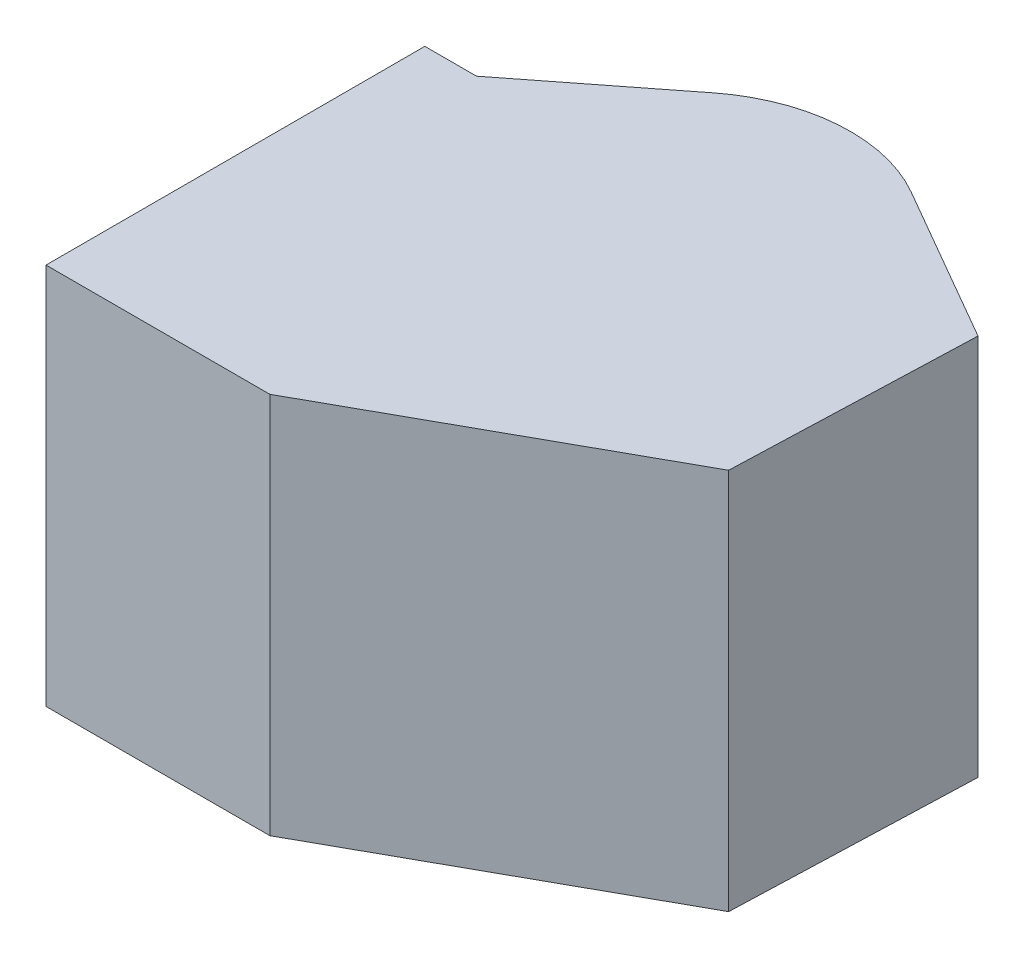
ISO-10303-21;
HEADER;
FILE_DESCRIPTION(('STEP AP214'),'2;1');
FILE_NAME('part.step','',(''),(''),'','','');
FILE_SCHEMA(('AUTOMOTIVE_DESIGN { 1 0 10303 214 1 1 1 1 }'));
ENDSEC;
DATA;
#1=APPLICATION_CONTEXT('core data for automotive mechanical design processes');
#2=APPLICATION_PROTOCOL_DEFINITION('international standard','automotive_design',2000,#1);
#3=PRODUCT_CONTEXT('',#1,'mechanical');
#4=PRODUCT('Part','Part','',(#3));
#5=PRODUCT_RELATED_PRODUCT_CATEGORY('part','',(#4));
#6=PRODUCT_DEFINITION_FORMATION('','',#4);
#7=PRODUCT_DEFINITION_CONTEXT('part definition',#1,'design');
#8=PRODUCT_DEFINITION('design','',#6,#7);
#9=PRODUCT_DEFINITION_SHAPE('','',#8);
#10=(LENGTH_UNIT() NAMED_UNIT(*) SI_UNIT(.MILLI.,.METRE.));
#11=(NAMED_UNIT(*) PLANE_ANGLE_UNIT() SI_UNIT($,.RADIAN.));
#12=(NAMED_UNIT(*) SI_UNIT($,.STERADIAN.) SOLID_ANGLE_UNIT());
#13=UNCERTAINTY_MEASURE_WITH_UNIT(LENGTH_MEASURE(1.E-05),#10,'distance_accuracy_value','');
#14=(GEOMETRIC_REPRESENTATION_CONTEXT(3) GLOBAL_UNCERTAINTY_ASSIGNED_CONTEXT((#13)) GLOBAL_UNIT_ASSIGNED_CONTEXT((#10,
#11,#12)) REPRESENTATION_CONTEXT('',''));
#15=CARTESIAN_POINT('',(0.,0.,0.));
#16=DIRECTION('',(0.,0.,1.));
#17=DIRECTION('',(1.,0.,0.));
#18=AXIS2_PLACEMENT_3D('',#15,#16,#17);
#19=CARTESIAN_POINT('',(-83.2176409176913,-55.5,55.));
#20=DIRECTION('',(-1.,0.,0.));
#21=DIRECTION('',(0.,0.,1.));
#22=AXIS2_PLACEMENT_3D('',#19,#20,#21);
#23=PLANE('',#22);
#24=CARTESIAN_POINT('',(-83.2176409176913,0.,0.));
#25=DIRECTION('',(-1.,0.,0.));
#26=DIRECTION('',(0.,0.,1.));
#27=AXIS2_PLACEMENT_3D('',#24,#25,#26);
#28=CIRCLE('',#27,48.);
#29=CARTESIAN_POINT('',(-83.2176409176913,0.,48.));
#30=VERTEX_POINT('',#29);
#31=EDGE_CURVE('E11',#30,#30,#28,.F.);
#32=ORIENTED_EDGE('',*,*,#31,.T.);
#33=EDGE_LOOP('',(#32));
#34=FACE_BOUND('',#33,.T.);
#35=DIRECTION('',(0.,1.,0.));
#36=VECTOR('',#35,1.);
#37=CARTESIAN_POINT('',(-83.2176409176913,-55.5,55.));
#38=LINE('',#37,#36);
#39=CARTESIAN_POINT('',(-83.2176409176913,-55.5,55.));
#40=VERTEX_POINT('',#39);
#41=CARTESIAN_POINT('',(-83.2176409176913,55.5,55.));
#42=VERTEX_POINT('',#41);
#43=EDGE_CURVE('E101',#40,#42,#38,.T.);
#44=ORIENTED_EDGE('',*,*,#43,.T.);
#45=DIRECTION('',(0.,0.,1.));
#46=VECTOR('',#45,1.);
#47=CARTESIAN_POINT('',(-83.2176409176913,55.5,55.));
#48=LINE('',#47,#46);
#49=CARTESIAN_POINT('',(-83.2176409176913,55.5,-55.));
#50=VERTEX_POINT('',#49);
#51=EDGE_CURVE('E104',#50,#42,#48,.T.);
#52=ORIENTED_EDGE('',*,*,#51,.F.);
#53=DIRECTION('',(0.,1.,0.));
#54=VECTOR('',#53,1.);
#55=CARTESIAN_POINT('',(-83.2176409176913,-55.5,-55.));
#56=LINE('',#55,#54);
#57=CARTESIAN_POINT('',(-83.2176409176913,-55.5,-55.));
#58=VERTEX_POINT('',#57);
#59=EDGE_CURVE('E52',#58,#50,#56,.T.);
#60=ORIENTED_EDGE('',*,*,#59,.F.);
#61=DIRECTION('',(0.,0.,1.));
#62=VECTOR('',#61,1.);
#63=CARTESIAN_POINT('',(-83.2176409176913,-55.5,55.));
#64=LINE('',#63,#62);
#65=EDGE_CURVE('E105',#58,#40,#64,.T.);
#66=ORIENTED_EDGE('',*,*,#65,.T.);
#67=EDGE_LOOP('',(#44,#52,#60,#66));
#68=FACE_BOUND('',#67,.T.);
#69=ADVANCED_FACE('F37',(#34,#68),#23,.T.);
#70=CARTESIAN_POINT('',(-83.2176409176913,-55.5,-55.));
#71=DIRECTION('',(0.,0.,-1.));
#72=DIRECTION('',(-1.,0.,0.));
#73=AXIS2_PLACEMENT_3D('',#70,#71,#72);
#74=PLANE('',#73);
#75=ORIENTED_EDGE('',*,*,#59,.T.);
#76=DIRECTION('',(-1.,0.,0.));
#77=VECTOR('',#76,1.);
#78=CARTESIAN_POINT('',(-83.2176409176913,55.5,-55.));
#79=LINE('',#78,#77);
#80=CARTESIAN_POINT('',(-68.2176409176913,55.5,-55.));
#81=VERTEX_POINT('',#80);
#82=EDGE_CURVE('E123',#81,#50,#79,.T.);
#83=ORIENTED_EDGE('',*,*,#82,.F.);
#84=DIRECTION('',(0.,1.,0.));
#85=VECTOR('',#84,1.);
#86=CARTESIAN_POINT('',(-68.2176409176913,-55.5,-55.));
#87=LINE('',#86,#85);
#88=CARTESIAN_POINT('',(-68.2176409176913,-55.5,-55.));
#89=VERTEX_POINT('',#88);
#90=EDGE_CURVE('E60',#89,#81,#87,.T.);
#91=ORIENTED_EDGE('',*,*,#90,.F.);
#92=DIRECTION('',(-1.,0.,0.));
#93=VECTOR('',#92,1.);
#94=CARTESIAN_POINT('',(-83.2176409176913,-55.5,-55.));
#95=LINE('',#94,#93);
#96=EDGE_CURVE('E110',#89,#58,#95,.T.);
#97=ORIENTED_EDGE('',*,*,#96,.T.);
#98=EDGE_LOOP('',(#75,#83,#91,#97));
#99=FACE_BOUND('',#98,.T.);
#100=ADVANCED_FACE('F186',(#99),#74,.T.);
#101=CARTESIAN_POINT('',(-68.2176409176913,-55.5,-55.));
#102=DIRECTION('',(-0.616245202756183,0.,-0.787554347381811));
#103=DIRECTION('',(-0.787554347381811,0.,0.616245202756184));
#104=AXIS2_PLACEMENT_3D('',#101,#102,#103);
#105=PLANE('',#104);
#106=ORIENTED_EDGE('',*,*,#90,.T.);
#107=DIRECTION('',(-0.787554347381811,0.,0.616245202756184));
#108=VECTOR('',#107,1.);
#109=CARTESIAN_POINT('',(-68.2176409176913,55.5,-55.));
#110=LINE('',#109,#108);
#111=CARTESIAN_POINT('',(-29.6274778959825,55.5,-85.196014935053));
#112=VERTEX_POINT('',#111);
#113=EDGE_CURVE('E139',#112,#81,#110,.T.);
#114=ORIENTED_EDGE('',*,*,#113,.F.);
#115=DIRECTION('',(0.,1.,0.));
#116=VECTOR('',#115,1.);
#117=CARTESIAN_POINT('',(-29.6274778959825,-55.5,-85.196014935053));
#118=LINE('',#117,#116);
#119=CARTESIAN_POINT('',(-29.6274778959825,-55.5,-85.196014935053));
#120=VERTEX_POINT('',#119);
#121=EDGE_CURVE('E162',#120,#112,#118,.T.);
#122=ORIENTED_EDGE('',*,*,#121,.F.);
#123=DIRECTION('',(-0.787554347381811,0.,0.616245202756184));
#124=VECTOR('',#123,1.);
#125=CARTESIAN_POINT('',(-68.2176409176913,-55.5,-55.));
#126=LINE('',#125,#124);
#127=EDGE_CURVE('E157',#120,#89,#126,.T.);
#128=ORIENTED_EDGE('',*,*,#127,.T.);
#129=EDGE_LOOP('',(#106,#114,#122,#128));
#130=FACE_BOUND('',#129,.T.);
#131=ADVANCED_FACE('F191',(#130),#105,.T.);
#132=CARTESIAN_POINT('',(0.,-55.5,-47.3324357711412));
#133=DIRECTION('',(0.,1.,0.));
#134=DIRECTION('',(0.,0.,1.));
#135=AXIS2_PLACEMENT_3D('',#132,#133,#134);
#136=CYLINDRICAL_SURFACE('',#135,48.0774175011382);
#137=ORIENTED_EDGE('',*,*,#121,.T.);
#138=CARTESIAN_POINT('',(0.,55.5,-47.3324357711412));
#139=DIRECTION('',(0.,1.,0.));
#140=DIRECTION('',(0.,0.,1.));
#141=AXIS2_PLACEMENT_3D('',#138,#139,#140);
#142=CIRCLE('',#141,48.0774175011382);
#143=CARTESIAN_POINT('',(24.0387087505688,55.5,-88.9687006754776));
#144=VERTEX_POINT('',#143);
#145=EDGE_CURVE('E136',#144,#112,#142,.T.);
#146=ORIENTED_EDGE('',*,*,#145,.F.);
#147=DIRECTION('',(0.,1.,0.));
#148=VECTOR('',#147,1.);
#149=CARTESIAN_POINT('',(24.0387087505688,-55.5,-88.9687006754776));
#150=LINE('',#149,#148);
#151=CARTESIAN_POINT('',(24.0387087505688,-55.5,-88.9687006754776));
#152=VERTEX_POINT('',#151);
#153=EDGE_CURVE('E164',#152,#144,#150,.T.);
#154=ORIENTED_EDGE('',*,*,#153,.F.);
#155=CARTESIAN_POINT('',(0.,-55.5,-47.3324357711412));
#156=DIRECTION('',(0.,1.,0.));
#157=DIRECTION('',(0.,0.,1.));
#158=AXIS2_PLACEMENT_3D('',#155,#156,#157);
#159=CIRCLE('',#158,48.0774175011382);
#160=EDGE_CURVE('E154',#152,#120,#159,.T.);
#161=ORIENTED_EDGE('',*,*,#160,.T.);
#162=EDGE_LOOP('',(#137,#146,#154,#161));
#163=FACE_BOUND('',#162,.T.);
#164=ADVANCED_FACE('F208',(#163),#136,.T.);
#165=CARTESIAN_POINT('',(69.9380551511442,-55.5,-62.4687006754779));
#166=DIRECTION('',(0.499999999999994,0.,-0.866025403784442));
#167=DIRECTION('',(-0.866025403784442,0.,-0.499999999999995));
#168=AXIS2_PLACEMENT_3D('',#165,#166,#167);
#169=PLANE('',#168);
#170=ORIENTED_EDGE('',*,*,#153,.T.);
#171=DIRECTION('',(-0.866025403784442,0.,-0.499999999999994));
#172=VECTOR('',#171,1.);
#173=CARTESIAN_POINT('',(69.9380551511442,55.5,-62.4687006754779));
#174=LINE('',#173,#172);
#175=CARTESIAN_POINT('',(69.9380551511442,55.5,-62.4687006754779));
#176=VERTEX_POINT('',#175);
#177=EDGE_CURVE('E133',#176,#144,#174,.T.);
#178=ORIENTED_EDGE('',*,*,#177,.F.);
#179=DIRECTION('',(0.,1.,0.));
#180=VECTOR('',#179,1.);
#181=CARTESIAN_POINT('',(69.9380551511442,-55.5,-62.4687006754779));
#182=LINE('',#181,#180);
#183=CARTESIAN_POINT('',(69.9380551511442,-55.5,-62.4687006754779));
#184=VERTEX_POINT('',#183);
#185=EDGE_CURVE('E166',#184,#176,#182,.T.);
#186=ORIENTED_EDGE('',*,*,#185,.F.);
#187=DIRECTION('',(-0.866025403784442,0.,-0.499999999999994));
#188=VECTOR('',#187,1.);
#189=CARTESIAN_POINT('',(69.9380551511442,-55.5,-62.4687006754779));
#190=LINE('',#189,#188);
#191=EDGE_CURVE('E151',#184,#152,#190,.T.);
#192=ORIENTED_EDGE('',*,*,#191,.T.);
#193=EDGE_LOOP('',(#170,#178,#186,#192));
#194=FACE_BOUND('',#193,.T.);
#195=ADVANCED_FACE('F204',(#194),#169,.T.);
#196=CARTESIAN_POINT('',(67.4950903819694,-55.5,7.48865721585882));
#197=DIRECTION('',(0.999390827019096,0.,0.0348994967024967));
#198=DIRECTION('',(0.0348994967024967,0.,-0.999390827019096));
#199=AXIS2_PLACEMENT_3D('',#196,#197,#198);
#200=PLANE('',#199);
#201=ORIENTED_EDGE('',*,*,#185,.T.);
#202=DIRECTION('',(0.0348994967024967,0.,-0.999390827019096));
#203=VECTOR('',#202,1.);
#204=CARTESIAN_POINT('',(67.4950903819694,55.5,7.48865721585882));
#205=LINE('',#204,#203);
#206=CARTESIAN_POINT('',(67.4950903819694,55.5,7.48865721585882));
#207=VERTEX_POINT('',#206);
#208=EDGE_CURVE('E130',#207,#176,#205,.T.);
#209=ORIENTED_EDGE('',*,*,#208,.F.);
#210=DIRECTION('',(0.,1.,0.));
#211=VECTOR('',#210,1.);
#212=CARTESIAN_POINT('',(67.4950903819694,-55.5,7.48865721585882));
#213=LINE('',#212,#211);
#214=CARTESIAN_POINT('',(67.4950903819694,-55.5,7.48865721585882));
#215=VERTEX_POINT('',#214);
#216=EDGE_CURVE('E168',#215,#207,#213,.T.);
#217=ORIENTED_EDGE('',*,*,#216,.F.);
#218=DIRECTION('',(0.0348994967024967,0.,-0.999390827019096));
#219=VECTOR('',#218,1.);
#220=CARTESIAN_POINT('',(67.4950903819694,-55.5,7.48865721585882));
#221=LINE('',#220,#219);
#222=EDGE_CURVE('E148',#215,#184,#221,.T.);
#223=ORIENTED_EDGE('',*,*,#222,.T.);
#224=EDGE_LOOP('',(#201,#209,#217,#223));
#225=FACE_BOUND('',#224,.T.);
#226=ADVANCED_FACE('F200',(#225),#200,.T.);
#227=CARTESIAN_POINT('',(-18.2176409176913,-55.5,55.));
#228=DIRECTION('',(0.484809620246338,0.,0.874619707139395));
#229=DIRECTION('',(0.874619707139395,0.,-0.484809620246338));
#230=AXIS2_PLACEMENT_3D('',#227,#228,#229);
#231=PLANE('',#230);
#232=ORIENTED_EDGE('',*,*,#216,.T.);
#233=DIRECTION('',(0.874619707139395,0.,-0.484809620246338));
#234=VECTOR('',#233,1.);
#235=CARTESIAN_POINT('',(-18.2176409176913,55.5,55.));
#236=LINE('',#235,#234);
#237=CARTESIAN_POINT('',(-18.2176409176913,55.5,55.));
#238=VERTEX_POINT('',#237);
#239=EDGE_CURVE('E118',#238,#207,#236,.T.);
#240=ORIENTED_EDGE('',*,*,#239,.F.);
#241=DIRECTION('',(0.,1.,0.));
#242=VECTOR('',#241,1.);
#243=CARTESIAN_POINT('',(-18.2176409176913,-55.5,55.));
#244=LINE('',#243,#242);
#245=CARTESIAN_POINT('',(-18.2176409176913,-55.5,55.));
#246=VERTEX_POINT('',#245);
#247=EDGE_CURVE('E109',#246,#238,#244,.T.);
#248=ORIENTED_EDGE('',*,*,#247,.F.);
#249=DIRECTION('',(0.874619707139395,0.,-0.484809620246338));
#250=VECTOR('',#249,1.);
#251=CARTESIAN_POINT('',(-18.2176409176913,-55.5,55.));
#252=LINE('',#251,#250);
#253=EDGE_CURVE('E145',#246,#215,#252,.T.);
#254=ORIENTED_EDGE('',*,*,#253,.T.);
#255=EDGE_LOOP('',(#232,#240,#248,#254));
#256=FACE_BOUND('',#255,.T.);
#257=ADVANCED_FACE('F197',(#256),#231,.T.);
#258=CARTESIAN_POINT('',(-83.2176409176913,-55.5,55.));
#259=DIRECTION('',(0.,0.,1.));
#260=DIRECTION('',(1.,0.,0.));
#261=AXIS2_PLACEMENT_3D('',#258,#259,#260);
#262=PLANE('',#261);
#263=ORIENTED_EDGE('',*,*,#247,.T.);
#264=DIRECTION('',(1.,0.,0.));
#265=VECTOR('',#264,1.);
#266=CARTESIAN_POINT('',(-83.2176409176913,55.5,55.));
#267=LINE('',#266,#265);
#268=EDGE_CURVE('E113',#42,#238,#267,.T.);
#269=ORIENTED_EDGE('',*,*,#268,.F.);
#270=ORIENTED_EDGE('',*,*,#43,.F.);
#271=DIRECTION('',(1.,0.,0.));
#272=VECTOR('',#271,1.);
#273=CARTESIAN_POINT('',(-83.2176409176913,-55.5,55.));
#274=LINE('',#273,#272);
#275=EDGE_CURVE('E143',#40,#246,#274,.T.);
#276=ORIENTED_EDGE('',*,*,#275,.T.);
#277=EDGE_LOOP('',(#263,#269,#270,#276));
#278=FACE_BOUND('',#277,.T.);
#279=ADVANCED_FACE('F114',(#278),#262,.T.);
#280=CARTESIAN_POINT('',(0.,-55.5,-47.3324357711412));
#281=DIRECTION('',(0.,1.,0.));
#282=DIRECTION('',(0.,0.,1.));
#283=AXIS2_PLACEMENT_3D('',#280,#281,#282);
#284=PLANE('',#283);
#285=ORIENTED_EDGE('',*,*,#65,.F.);
#286=ORIENTED_EDGE('',*,*,#96,.F.);
#287=ORIENTED_EDGE('',*,*,#127,.F.);
#288=ORIENTED_EDGE('',*,*,#160,.F.);
#289=ORIENTED_EDGE('',*,*,#191,.F.);
#290=ORIENTED_EDGE('',*,*,#222,.F.);
#291=ORIENTED_EDGE('',*,*,#253,.F.);
#292=ORIENTED_EDGE('',*,*,#275,.F.);
#293=EDGE_LOOP('',(#285,#286,#287,#288,#289,#290,#291,#292));
#294=FACE_BOUND('',#293,.T.);
#295=ADVANCED_FACE('F196',(#294),#284,.F.);
#296=CARTESIAN_POINT('',(0.,55.5,-47.3324357711412));
#297=DIRECTION('',(0.,1.,0.));
#298=DIRECTION('',(0.,0.,1.));
#299=AXIS2_PLACEMENT_3D('',#296,#297,#298);
#300=PLANE('',#299);
#301=ORIENTED_EDGE('',*,*,#51,.T.);
#302=ORIENTED_EDGE('',*,*,#268,.T.);
#303=ORIENTED_EDGE('',*,*,#239,.T.);
#304=ORIENTED_EDGE('',*,*,#208,.T.);
#305=ORIENTED_EDGE('',*,*,#177,.T.);
#306=ORIENTED_EDGE('',*,*,#145,.T.);
#307=ORIENTED_EDGE('',*,*,#113,.T.);
#308=ORIENTED_EDGE('',*,*,#82,.T.);
#309=EDGE_LOOP('',(#301,#302,#303,#304,#305,#306,#307,#308));
#310=FACE_BOUND('',#309,.T.);
#311=ADVANCED_FACE('F121',(#310),#300,.T.);
#312=CARTESIAN_POINT('',(-93.2176409176913,0.,0.));
#313=DIRECTION('',(1.,0.,0.));
#314=DIRECTION('',(0.,0.,-1.));
#315=AXIS2_PLACEMENT_3D('',#312,#313,#314);
#316=CYLINDRICAL_SURFACE('',#315,45.);
#317=CARTESIAN_POINT('',(-86.2176409176913,0.,0.));
#318=DIRECTION('',(-1.,0.,0.));
#319=DIRECTION('',(0.,0.,1.));
#320=AXIS2_PLACEMENT_3D('',#317,#318,#319);
#321=CIRCLE('',#320,45.);
#322=CARTESIAN_POINT('',(-86.2176409176913,0.,45.));
#323=VERTEX_POINT('',#322);
#324=EDGE_CURVE('E45',#323,#323,#321,.T.);
#325=ORIENTED_EDGE('',*,*,#324,.T.);
#326=EDGE_LOOP('',(#325));
#327=FACE_BOUND('',#326,.T.);
#328=CARTESIAN_POINT('',(-93.2176409176913,0.,0.));
#329=DIRECTION('',(-1.,0.,0.));
#330=DIRECTION('',(0.,0.,1.));
#331=AXIS2_PLACEMENT_3D('',#328,#329,#330);
#332=CIRCLE('',#331,45.);
#333=CARTESIAN_POINT('',(-93.2176409176913,0.,45.));
#334=VERTEX_POINT('',#333);
#335=EDGE_CURVE('E124',#334,#334,#332,.T.);
#336=ORIENTED_EDGE('',*,*,#335,.F.);
#337=EDGE_LOOP('',(#336));
#338=FACE_BOUND('',#337,.T.);
#339=ADVANCED_FACE('F173',(#327,#338),#316,.T.);
#340=CARTESIAN_POINT('',(-93.2176409176913,0.,0.));
#341=DIRECTION('',(-1.,0.,0.));
#342=DIRECTION('',(0.,0.,1.));
#343=AXIS2_PLACEMENT_3D('',#340,#341,#342);
#344=PLANE('',#343);
#345=ORIENTED_EDGE('',*,*,#335,.T.);
#346=EDGE_LOOP('',(#345));
#347=FACE_BOUND('',#346,.T.);
#348=ADVANCED_FACE('F177',(#347),#344,.T.);
#349=CARTESIAN_POINT('',(-86.2176409176913,0.,0.));
#350=DIRECTION('',(-1.,0.,0.));
#351=DIRECTION('',(0.,0.,1.));
#352=AXIS2_PLACEMENT_3D('',#349,#350,#351);
#353=TOROIDAL_SURFACE('',#352,48.,3.);
#354=ORIENTED_EDGE('',*,*,#31,.F.);
#355=EDGE_LOOP('',(#354));
#356=FACE_BOUND('',#355,.T.);
#357=ORIENTED_EDGE('',*,*,#324,.F.);
#358=EDGE_LOOP('',(#357));
#359=FACE_BOUND('',#358,.T.);
#360=ADVANCED_FACE('F39',(#356,#359),#353,.F.);
#361=CLOSED_SHELL('',(#69,#100,#131,#164,#195,#226,#257,#279,#295,#311,#339,#348,#360));
#362=MANIFOLD_SOLID_BREP('B2',#361);
#363=ADVANCED_BREP_SHAPE_REPRESENTATION('',(#18,#362),#14);
#364=SHAPE_DEFINITION_REPRESENTATION(#9,#363);
ENDSEC;
END-ISO-10303-21;
